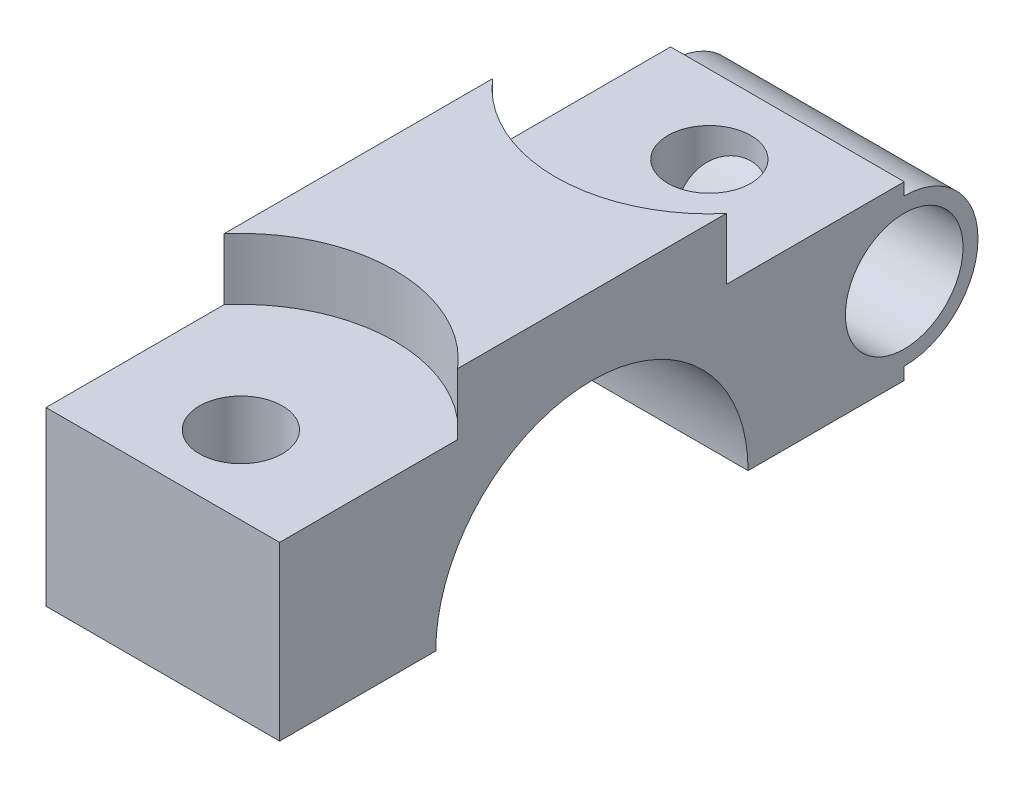
ISO-10303-21;
HEADER;
FILE_DESCRIPTION(('STEP AP214'),'2;1');
FILE_NAME('part.step','',(''),(''),'','','');
FILE_SCHEMA(('AUTOMOTIVE_DESIGN { 1 0 10303 214 1 1 1 1 }'));
ENDSEC;
DATA;
#1=APPLICATION_CONTEXT('core data for automotive mechanical design processes');
#2=APPLICATION_PROTOCOL_DEFINITION('international standard','automotive_design',2000,#1);
#3=PRODUCT_CONTEXT('',#1,'mechanical');
#4=PRODUCT('Part','Part','',(#3));
#5=PRODUCT_RELATED_PRODUCT_CATEGORY('part','',(#4));
#6=PRODUCT_DEFINITION_FORMATION('','',#4);
#7=PRODUCT_DEFINITION_CONTEXT('part definition',#1,'design');
#8=PRODUCT_DEFINITION('design','',#6,#7);
#9=PRODUCT_DEFINITION_SHAPE('','',#8);
#10=(LENGTH_UNIT() NAMED_UNIT(*) SI_UNIT(.MILLI.,.METRE.));
#11=(NAMED_UNIT(*) PLANE_ANGLE_UNIT() SI_UNIT($,.RADIAN.));
#12=(NAMED_UNIT(*) SI_UNIT($,.STERADIAN.) SOLID_ANGLE_UNIT());
#13=UNCERTAINTY_MEASURE_WITH_UNIT(LENGTH_MEASURE(1.E-05),#10,'distance_accuracy_value','');
#14=(GEOMETRIC_REPRESENTATION_CONTEXT(3) GLOBAL_UNCERTAINTY_ASSIGNED_CONTEXT((#13)) GLOBAL_UNIT_ASSIGNED_CONTEXT((#10,
#11,#12)) REPRESENTATION_CONTEXT('',''));
#15=CARTESIAN_POINT('',(0.,0.,0.));
#16=DIRECTION('',(0.,0.,1.));
#17=DIRECTION('',(1.,0.,0.));
#18=AXIS2_PLACEMENT_3D('',#15,#16,#17);
#19=CARTESIAN_POINT('',(9.5,19.,-25.4));
#20=DIRECTION('',(0.,0.,1.));
#21=DIRECTION('',(0.,-1.,0.));
#22=AXIS2_PLACEMENT_3D('',#19,#20,#21);
#23=PLANE('',#22);
#24=DIRECTION('',(0.,1.,0.));
#25=VECTOR('',#24,1.);
#26=CARTESIAN_POINT('',(-9.5,19.,-25.4));
#27=LINE('',#26,#25);
#28=CARTESIAN_POINT('',(-9.5,0.,-25.4));
#29=VERTEX_POINT('',#28);
#30=CARTESIAN_POINT('',(-9.5,1.,-25.4));
#31=VERTEX_POINT('',#30);
#32=EDGE_CURVE('E199',#29,#31,#27,.T.);
#33=ORIENTED_EDGE('',*,*,#32,.T.);
#34=DIRECTION('',(1.,0.,0.));
#35=VECTOR('',#34,1.);
#36=CARTESIAN_POINT('',(-9.5,1.,-25.4));
#37=LINE('',#36,#35);
#38=CARTESIAN_POINT('',(9.5,1.,-25.4));
#39=VERTEX_POINT('',#38);
#40=EDGE_CURVE('E66',#31,#39,#37,.T.);
#41=ORIENTED_EDGE('',*,*,#40,.T.);
#42=DIRECTION('',(0.,1.,0.));
#43=VECTOR('',#42,1.);
#44=CARTESIAN_POINT('',(9.5,19.,-25.4));
#45=LINE('',#44,#43);
#46=CARTESIAN_POINT('',(9.5,0.,-25.4));
#47=VERTEX_POINT('',#46);
#48=EDGE_CURVE('E186',#47,#39,#45,.T.);
#49=ORIENTED_EDGE('',*,*,#48,.F.);
#50=DIRECTION('',(-1.,0.,0.));
#51=VECTOR('',#50,1.);
#52=CARTESIAN_POINT('',(9.5,0.,-25.4));
#53=LINE('',#52,#51);
#54=EDGE_CURVE('E190',#47,#29,#53,.T.);
#55=ORIENTED_EDGE('',*,*,#54,.T.);
#56=EDGE_LOOP('',(#33,#41,#49,#55));
#57=FACE_BOUND('',#56,.T.);
#58=ADVANCED_FACE('F37',(#57),#23,.F.);
#59=CARTESIAN_POINT('',(9.5,19.,25.4));
#60=DIRECTION('',(0.,-1.,0.));
#61=DIRECTION('',(0.,0.,-1.));
#62=AXIS2_PLACEMENT_3D('',#59,#60,#61);
#63=PLANE('',#62);
#64=DIRECTION('',(0.,0.,1.));
#65=VECTOR('',#64,1.);
#66=CARTESIAN_POINT('',(9.5,19.,25.4));
#67=LINE('',#66,#65);
#68=CARTESIAN_POINT('',(9.5,19.,-10.925961595364));
#69=VERTEX_POINT('',#68);
#70=CARTESIAN_POINT('',(9.5,19.,10.925961595364));
#71=VERTEX_POINT('',#70);
#72=EDGE_CURVE('E188',#69,#71,#67,.T.);
#73=ORIENTED_EDGE('',*,*,#72,.F.);
#74=CARTESIAN_POINT('',(0.,19.,-19.05));
#75=DIRECTION('',(0.,1.,0.));
#76=DIRECTION('',(0.,0.,1.));
#77=AXIS2_PLACEMENT_3D('',#74,#75,#76);
#78=CIRCLE('',#77,12.5);
#79=CARTESIAN_POINT('',(-9.5,19.,-10.925961595364));
#80=VERTEX_POINT('',#79);
#81=EDGE_CURVE('E138',#80,#69,#78,.T.);
#82=ORIENTED_EDGE('',*,*,#81,.F.);
#83=DIRECTION('',(0.,0.,1.));
#84=VECTOR('',#83,1.);
#85=CARTESIAN_POINT('',(-9.5,19.,25.4));
#86=LINE('',#85,#84);
#87=CARTESIAN_POINT('',(-9.5,19.,10.925961595364));
#88=VERTEX_POINT('',#87);
#89=EDGE_CURVE('E180',#80,#88,#86,.T.);
#90=ORIENTED_EDGE('',*,*,#89,.T.);
#91=CARTESIAN_POINT('',(0.,19.,19.05));
#92=DIRECTION('',(0.,1.,0.));
#93=DIRECTION('',(0.,0.,1.));
#94=AXIS2_PLACEMENT_3D('',#91,#92,#93);
#95=CIRCLE('',#94,12.5);
#96=EDGE_CURVE('E142',#71,#88,#95,.T.);
#97=ORIENTED_EDGE('',*,*,#96,.F.);
#98=EDGE_LOOP('',(#73,#82,#90,#97));
#99=FACE_BOUND('',#98,.T.);
#100=ADVANCED_FACE('F248',(#99),#63,.F.);
#101=CARTESIAN_POINT('',(9.5,19.,25.4));
#102=DIRECTION('',(0.,0.,-1.));
#103=DIRECTION('',(0.,1.,0.));
#104=AXIS2_PLACEMENT_3D('',#101,#102,#103);
#105=PLANE('',#104);
#106=DIRECTION('',(0.,-1.,0.));
#107=VECTOR('',#106,1.);
#108=CARTESIAN_POINT('',(9.5,19.,25.4));
#109=LINE('',#108,#107);
#110=CARTESIAN_POINT('',(9.5,14.,25.4));
#111=VERTEX_POINT('',#110);
#112=CARTESIAN_POINT('',(9.5,0.,25.4));
#113=VERTEX_POINT('',#112);
#114=EDGE_CURVE('E177',#111,#113,#109,.T.);
#115=ORIENTED_EDGE('',*,*,#114,.F.);
#116=DIRECTION('',(-1.,0.,0.));
#117=VECTOR('',#116,1.);
#118=CARTESIAN_POINT('',(9.5,14.,25.4));
#119=LINE('',#118,#117);
#120=CARTESIAN_POINT('',(-9.5,14.,25.4));
#121=VERTEX_POINT('',#120);
#122=EDGE_CURVE('E173',#111,#121,#119,.T.);
#123=ORIENTED_EDGE('',*,*,#122,.T.);
#124=DIRECTION('',(0.,-1.,0.));
#125=VECTOR('',#124,1.);
#126=CARTESIAN_POINT('',(-9.5,19.,25.4));
#127=LINE('',#126,#125);
#128=CARTESIAN_POINT('',(-9.5,0.,25.4));
#129=VERTEX_POINT('',#128);
#130=EDGE_CURVE('E176',#121,#129,#127,.T.);
#131=ORIENTED_EDGE('',*,*,#130,.T.);
#132=DIRECTION('',(-1.,0.,0.));
#133=VECTOR('',#132,1.);
#134=CARTESIAN_POINT('',(9.5,0.,25.4));
#135=LINE('',#134,#133);
#136=EDGE_CURVE('E210',#113,#129,#135,.T.);
#137=ORIENTED_EDGE('',*,*,#136,.F.);
#138=EDGE_LOOP('',(#115,#123,#131,#137));
#139=FACE_BOUND('',#138,.T.);
#140=ADVANCED_FACE('F39',(#139),#105,.F.);
#141=CARTESIAN_POINT('',(9.5,0.,25.4));
#142=DIRECTION('',(0.,1.,0.));
#143=DIRECTION('',(0.,0.,1.));
#144=AXIS2_PLACEMENT_3D('',#141,#142,#143);
#145=PLANE('',#144);
#146=CARTESIAN_POINT('',(0.,0.,19.05));
#147=DIRECTION('',(0.,1.,0.));
#148=DIRECTION('',(0.,0.,1.));
#149=AXIS2_PLACEMENT_3D('',#146,#147,#148);
#150=CIRCLE('',#149,3.37500000000003);
#151=CARTESIAN_POINT('',(0.,0.,22.425));
#152=VERTEX_POINT('',#151);
#153=EDGE_CURVE('E168',#152,#152,#150,.T.);
#154=ORIENTED_EDGE('',*,*,#153,.T.);
#155=EDGE_LOOP('',(#154));
#156=FACE_BOUND('',#155,.T.);
#157=DIRECTION('',(0.,0.,-1.));
#158=VECTOR('',#157,1.);
#159=CARTESIAN_POINT('',(-9.5,0.,25.4));
#160=LINE('',#159,#158);
#161=CARTESIAN_POINT('',(-9.5,0.,12.7));
#162=VERTEX_POINT('',#161);
#163=EDGE_CURVE('E192',#129,#162,#160,.T.);
#164=ORIENTED_EDGE('',*,*,#163,.T.);
#165=DIRECTION('',(-1.,0.,0.));
#166=VECTOR('',#165,1.);
#167=CARTESIAN_POINT('',(9.5,0.,12.7));
#168=LINE('',#167,#166);
#169=CARTESIAN_POINT('',(9.5,0.,12.7));
#170=VERTEX_POINT('',#169);
#171=EDGE_CURVE('E207',#170,#162,#168,.T.);
#172=ORIENTED_EDGE('',*,*,#171,.F.);
#173=DIRECTION('',(0.,0.,-1.));
#174=VECTOR('',#173,1.);
#175=CARTESIAN_POINT('',(9.5,0.,25.4));
#176=LINE('',#175,#174);
#177=EDGE_CURVE('E179',#113,#170,#176,.T.);
#178=ORIENTED_EDGE('',*,*,#177,.F.);
#179=ORIENTED_EDGE('',*,*,#136,.T.);
#180=EDGE_LOOP('',(#164,#172,#178,#179));
#181=FACE_BOUND('',#180,.T.);
#182=ADVANCED_FACE('F240',(#156,#181),#145,.F.);
#183=CARTESIAN_POINT('',(9.5,0.,0.));
#184=DIRECTION('',(-1.,0.,0.));
#185=DIRECTION('',(0.,0.,1.));
#186=AXIS2_PLACEMENT_3D('',#183,#184,#185);
#187=CYLINDRICAL_SURFACE('',#186,12.7);
#188=CARTESIAN_POINT('',(-9.5,0.,0.));
#189=DIRECTION('',(-1.,0.,0.));
#190=DIRECTION('',(0.,0.,1.));
#191=AXIS2_PLACEMENT_3D('',#188,#189,#190);
#192=CIRCLE('',#191,12.7);
#193=CARTESIAN_POINT('',(-9.5,0.,-12.7));
#194=VERTEX_POINT('',#193);
#195=EDGE_CURVE('E194',#162,#194,#192,.T.);
#196=ORIENTED_EDGE('',*,*,#195,.T.);
#197=DIRECTION('',(-1.,0.,0.));
#198=VECTOR('',#197,1.);
#199=CARTESIAN_POINT('',(9.5,0.,-12.7));
#200=LINE('',#199,#198);
#201=CARTESIAN_POINT('',(9.5,0.,-12.7));
#202=VERTEX_POINT('',#201);
#203=EDGE_CURVE('E204',#202,#194,#200,.T.);
#204=ORIENTED_EDGE('',*,*,#203,.F.);
#205=CARTESIAN_POINT('',(9.5,0.,0.));
#206=DIRECTION('',(-1.,0.,0.));
#207=DIRECTION('',(0.,0.,1.));
#208=AXIS2_PLACEMENT_3D('',#205,#206,#207);
#209=CIRCLE('',#208,12.7);
#210=EDGE_CURVE('E182',#170,#202,#209,.T.);
#211=ORIENTED_EDGE('',*,*,#210,.F.);
#212=ORIENTED_EDGE('',*,*,#171,.T.);
#213=EDGE_LOOP('',(#196,#204,#211,#212));
#214=FACE_BOUND('',#213,.T.);
#215=ADVANCED_FACE('F309',(#214),#187,.F.);
#216=CARTESIAN_POINT('',(9.5,0.,-12.7));
#217=DIRECTION('',(0.,1.,0.));
#218=DIRECTION('',(0.,0.,1.));
#219=AXIS2_PLACEMENT_3D('',#216,#217,#218);
#220=PLANE('',#219);
#221=CARTESIAN_POINT('',(0.,0.,-19.05));
#222=DIRECTION('',(0.,1.,0.));
#223=DIRECTION('',(0.,0.,1.));
#224=AXIS2_PLACEMENT_3D('',#221,#222,#223);
#225=CIRCLE('',#224,3.37500000000003);
#226=CARTESIAN_POINT('',(0.,0.,-15.675));
#227=VERTEX_POINT('',#226);
#228=EDGE_CURVE('E156',#227,#227,#225,.T.);
#229=ORIENTED_EDGE('',*,*,#228,.T.);
#230=EDGE_LOOP('',(#229));
#231=FACE_BOUND('',#230,.T.);
#232=DIRECTION('',(0.,0.,-1.));
#233=VECTOR('',#232,1.);
#234=CARTESIAN_POINT('',(-9.5,0.,-12.7));
#235=LINE('',#234,#233);
#236=EDGE_CURVE('E196',#194,#29,#235,.T.);
#237=ORIENTED_EDGE('',*,*,#236,.T.);
#238=ORIENTED_EDGE('',*,*,#54,.F.);
#239=DIRECTION('',(0.,0.,-1.));
#240=VECTOR('',#239,1.);
#241=CARTESIAN_POINT('',(9.5,0.,-12.7));
#242=LINE('',#241,#240);
#243=EDGE_CURVE('E184',#202,#47,#242,.T.);
#244=ORIENTED_EDGE('',*,*,#243,.F.);
#245=ORIENTED_EDGE('',*,*,#203,.T.);
#246=EDGE_LOOP('',(#237,#238,#244,#245));
#247=FACE_BOUND('',#246,.T.);
#248=ADVANCED_FACE('F276',(#231,#247),#220,.F.);
#249=CARTESIAN_POINT('',(9.5,13.,-25.4));
#250=VERTEX_POINT('',#249);
#251=CARTESIAN_POINT('',(9.5,14.,-25.4));
#252=VERTEX_POINT('',#251);
#253=EDGE_CURVE('E58',#250,#252,#45,.T.);
#254=ORIENTED_EDGE('',*,*,#253,.F.);
#255=DIRECTION('',(1.,0.,0.));
#256=VECTOR('',#255,1.);
#257=CARTESIAN_POINT('',(-9.5,13.,-25.4));
#258=LINE('',#257,#256);
#259=CARTESIAN_POINT('',(-9.5,13.,-25.4));
#260=VERTEX_POINT('',#259);
#261=EDGE_CURVE('E257',#250,#260,#258,.F.);
#262=ORIENTED_EDGE('',*,*,#261,.T.);
#263=CARTESIAN_POINT('',(-9.5,14.,-25.4));
#264=VERTEX_POINT('',#263);
#265=EDGE_CURVE('E198',#260,#264,#27,.T.);
#266=ORIENTED_EDGE('',*,*,#265,.T.);
#267=DIRECTION('',(1.,0.,0.));
#268=VECTOR('',#267,1.);
#269=CARTESIAN_POINT('',(9.5,14.,-25.4));
#270=LINE('',#269,#268);
#271=EDGE_CURVE('E154',#264,#252,#270,.T.);
#272=ORIENTED_EDGE('',*,*,#271,.T.);
#273=EDGE_LOOP('',(#254,#262,#266,#272));
#274=FACE_BOUND('',#273,.T.);
#275=ADVANCED_FACE('F295',(#274),#23,.F.);
#276=CARTESIAN_POINT('',(9.5,0.,0.));
#277=DIRECTION('',(-1.,0.,0.));
#278=DIRECTION('',(0.,0.,1.));
#279=AXIS2_PLACEMENT_3D('',#276,#277,#278);
#280=PLANE('',#279);
#281=CARTESIAN_POINT('',(9.5,7.,-25.4));
#282=DIRECTION('',(1.,0.,0.));
#283=DIRECTION('',(0.,0.,-1.));
#284=AXIS2_PLACEMENT_3D('',#281,#282,#283);
#285=CIRCLE('',#284,4.785);
#286=CARTESIAN_POINT('',(9.5,7.,-30.185));
#287=VERTEX_POINT('',#286);
#288=EDGE_CURVE('E265',#287,#287,#285,.T.);
#289=ORIENTED_EDGE('',*,*,#288,.F.);
#290=EDGE_LOOP('',(#289));
#291=FACE_BOUND('',#290,.T.);
#292=ORIENTED_EDGE('',*,*,#48,.T.);
#293=CARTESIAN_POINT('',(9.5,7.,-25.4));
#294=DIRECTION('',(1.,0.,0.));
#295=DIRECTION('',(0.,0.,-1.));
#296=AXIS2_PLACEMENT_3D('',#293,#294,#295);
#297=CIRCLE('',#296,6.);
#298=EDGE_CURVE('E258',#39,#250,#297,.T.);
#299=ORIENTED_EDGE('',*,*,#298,.T.);
#300=ORIENTED_EDGE('',*,*,#253,.T.);
#301=DIRECTION('',(0.,0.,1.));
#302=VECTOR('',#301,1.);
#303=CARTESIAN_POINT('',(9.5,14.,0.));
#304=LINE('',#303,#302);
#305=CARTESIAN_POINT('',(9.5,14.,-10.925961595364));
#306=VERTEX_POINT('',#305);
#307=EDGE_CURVE('E143',#252,#306,#304,.T.);
#308=ORIENTED_EDGE('',*,*,#307,.T.);
#309=DIRECTION('',(0.,1.,0.));
#310=VECTOR('',#309,1.);
#311=CARTESIAN_POINT('',(9.5,19.,-10.925961595364));
#312=LINE('',#311,#310);
#313=EDGE_CURVE('E132',#306,#69,#312,.T.);
#314=ORIENTED_EDGE('',*,*,#313,.T.);
#315=ORIENTED_EDGE('',*,*,#72,.T.);
#316=DIRECTION('',(0.,1.,0.));
#317=VECTOR('',#316,1.);
#318=CARTESIAN_POINT('',(9.5,19.,10.925961595364));
#319=LINE('',#318,#317);
#320=CARTESIAN_POINT('',(9.5,14.,10.925961595364));
#321=VERTEX_POINT('',#320);
#322=EDGE_CURVE('E213',#71,#321,#319,.F.);
#323=ORIENTED_EDGE('',*,*,#322,.T.);
#324=DIRECTION('',(0.,0.,1.));
#325=VECTOR('',#324,1.);
#326=CARTESIAN_POINT('',(9.5,14.,0.));
#327=LINE('',#326,#325);
#328=EDGE_CURVE('E216',#321,#111,#327,.T.);
#329=ORIENTED_EDGE('',*,*,#328,.T.);
#330=ORIENTED_EDGE('',*,*,#114,.T.);
#331=ORIENTED_EDGE('',*,*,#177,.T.);
#332=ORIENTED_EDGE('',*,*,#210,.T.);
#333=ORIENTED_EDGE('',*,*,#243,.T.);
#334=EDGE_LOOP('',(#292,#299,#300,#308,#314,#315,#323,#329,#330,#331,#332,#333));
#335=FACE_BOUND('',#334,.T.);
#336=ADVANCED_FACE('F152',(#291,#335),#280,.F.);
#337=CARTESIAN_POINT('',(-9.5,0.,0.));
#338=DIRECTION('',(-1.,0.,0.));
#339=DIRECTION('',(0.,0.,1.));
#340=AXIS2_PLACEMENT_3D('',#337,#338,#339);
#341=PLANE('',#340);
#342=CARTESIAN_POINT('',(-9.5,7.,-25.4));
#343=DIRECTION('',(1.,0.,0.));
#344=DIRECTION('',(0.,0.,-1.));
#345=AXIS2_PLACEMENT_3D('',#342,#343,#344);
#346=CIRCLE('',#345,4.785);
#347=CARTESIAN_POINT('',(-9.5,7.,-30.185));
#348=VERTEX_POINT('',#347);
#349=EDGE_CURVE('E266',#348,#348,#346,.T.);
#350=ORIENTED_EDGE('',*,*,#349,.T.);
#351=EDGE_LOOP('',(#350));
#352=FACE_BOUND('',#351,.T.);
#353=ORIENTED_EDGE('',*,*,#265,.F.);
#354=CARTESIAN_POINT('',(-9.5,7.,-25.4));
#355=DIRECTION('',(1.,0.,0.));
#356=DIRECTION('',(0.,0.,-1.));
#357=AXIS2_PLACEMENT_3D('',#354,#355,#356);
#358=CIRCLE('',#357,6.);
#359=EDGE_CURVE('E253',#31,#260,#358,.T.);
#360=ORIENTED_EDGE('',*,*,#359,.F.);
#361=ORIENTED_EDGE('',*,*,#32,.F.);
#362=ORIENTED_EDGE('',*,*,#236,.F.);
#363=ORIENTED_EDGE('',*,*,#195,.F.);
#364=ORIENTED_EDGE('',*,*,#163,.F.);
#365=ORIENTED_EDGE('',*,*,#130,.F.);
#366=DIRECTION('',(0.,0.,1.));
#367=VECTOR('',#366,1.);
#368=CARTESIAN_POINT('',(-9.5,14.,0.));
#369=LINE('',#368,#367);
#370=CARTESIAN_POINT('',(-9.5,14.,10.925961595364));
#371=VERTEX_POINT('',#370);
#372=EDGE_CURVE('E219',#371,#121,#369,.T.);
#373=ORIENTED_EDGE('',*,*,#372,.F.);
#374=DIRECTION('',(0.,1.,0.));
#375=VECTOR('',#374,1.);
#376=CARTESIAN_POINT('',(-9.5,19.,10.925961595364));
#377=LINE('',#376,#375);
#378=EDGE_CURVE('E171',#88,#371,#377,.F.);
#379=ORIENTED_EDGE('',*,*,#378,.F.);
#380=ORIENTED_EDGE('',*,*,#89,.F.);
#381=DIRECTION('',(0.,1.,0.));
#382=VECTOR('',#381,1.);
#383=CARTESIAN_POINT('',(-9.5,19.,-10.925961595364));
#384=LINE('',#383,#382);
#385=CARTESIAN_POINT('',(-9.5,14.,-10.925961595364));
#386=VERTEX_POINT('',#385);
#387=EDGE_CURVE('E11',#386,#80,#384,.T.);
#388=ORIENTED_EDGE('',*,*,#387,.F.);
#389=DIRECTION('',(0.,0.,1.));
#390=VECTOR('',#389,1.);
#391=CARTESIAN_POINT('',(-9.5,14.,0.));
#392=LINE('',#391,#390);
#393=EDGE_CURVE('E51',#264,#386,#392,.T.);
#394=ORIENTED_EDGE('',*,*,#393,.F.);
#395=EDGE_LOOP('',(#353,#360,#361,#362,#363,#364,#365,#373,#379,#380,#388,#394));
#396=FACE_BOUND('',#395,.T.);
#397=ADVANCED_FACE('F234',(#352,#396),#341,.T.);
#398=CARTESIAN_POINT('',(0.,19.,19.05));
#399=DIRECTION('',(0.,1.,0.));
#400=DIRECTION('',(0.,0.,1.));
#401=AXIS2_PLACEMENT_3D('',#398,#399,#400);
#402=CYLINDRICAL_SURFACE('',#401,3.37500000000004);
#403=ORIENTED_EDGE('',*,*,#153,.F.);
#404=EDGE_LOOP('',(#403));
#405=FACE_BOUND('',#404,.T.);
#406=CARTESIAN_POINT('',(0.,14.,19.05));
#407=DIRECTION('',(0.,1.,0.));
#408=DIRECTION('',(0.,0.,1.));
#409=AXIS2_PLACEMENT_3D('',#406,#407,#408);
#410=CIRCLE('',#409,3.37500000000004);
#411=CARTESIAN_POINT('',(0.,14.,22.425));
#412=VERTEX_POINT('',#411);
#413=EDGE_CURVE('E165',#412,#412,#410,.T.);
#414=ORIENTED_EDGE('',*,*,#413,.T.);
#415=EDGE_LOOP('',(#414));
#416=FACE_BOUND('',#415,.T.);
#417=ADVANCED_FACE('F322',(#405,#416),#402,.F.);
#418=CARTESIAN_POINT('',(3.37500000000004,14.,19.05));
#419=DIRECTION('',(0.,-1.,0.));
#420=DIRECTION('',(0.,0.,-1.));
#421=AXIS2_PLACEMENT_3D('',#418,#419,#420);
#422=PLANE('',#421);
#423=ORIENTED_EDGE('',*,*,#372,.T.);
#424=ORIENTED_EDGE('',*,*,#122,.F.);
#425=ORIENTED_EDGE('',*,*,#328,.F.);
#426=CARTESIAN_POINT('',(0.,14.,19.05));
#427=DIRECTION('',(0.,1.,0.));
#428=DIRECTION('',(0.,0.,1.));
#429=AXIS2_PLACEMENT_3D('',#426,#427,#428);
#430=CIRCLE('',#429,12.5);
#431=EDGE_CURVE('E162',#321,#371,#430,.T.);
#432=ORIENTED_EDGE('',*,*,#431,.T.);
#433=EDGE_LOOP('',(#423,#424,#425,#432));
#434=FACE_BOUND('',#433,.T.);
#435=ORIENTED_EDGE('',*,*,#413,.F.);
#436=EDGE_LOOP('',(#435));
#437=FACE_BOUND('',#436,.T.);
#438=ADVANCED_FACE('F223',(#434,#437),#422,.F.);
#439=CARTESIAN_POINT('',(0.,19.,19.05));
#440=DIRECTION('',(0.,1.,0.));
#441=DIRECTION('',(0.,0.,1.));
#442=AXIS2_PLACEMENT_3D('',#439,#440,#441);
#443=CYLINDRICAL_SURFACE('',#442,12.5);
#444=ORIENTED_EDGE('',*,*,#378,.T.);
#445=ORIENTED_EDGE('',*,*,#431,.F.);
#446=ORIENTED_EDGE('',*,*,#322,.F.);
#447=ORIENTED_EDGE('',*,*,#96,.T.);
#448=EDGE_LOOP('',(#444,#445,#446,#447));
#449=FACE_BOUND('',#448,.T.);
#450=ADVANCED_FACE('F246',(#449),#443,.F.);
#451=CARTESIAN_POINT('',(0.,19.,-19.05));
#452=DIRECTION('',(0.,1.,0.));
#453=DIRECTION('',(0.,0.,1.));
#454=AXIS2_PLACEMENT_3D('',#451,#452,#453);
#455=CYLINDRICAL_SURFACE('',#454,12.5);
#456=CARTESIAN_POINT('',(0.,14.,-19.05));
#457=DIRECTION('',(0.,1.,0.));
#458=DIRECTION('',(0.,0.,1.));
#459=AXIS2_PLACEMENT_3D('',#456,#457,#458);
#460=CIRCLE('',#459,12.5);
#461=EDGE_CURVE('E135',#386,#306,#460,.T.);
#462=ORIENTED_EDGE('',*,*,#461,.F.);
#463=ORIENTED_EDGE('',*,*,#387,.T.);
#464=ORIENTED_EDGE('',*,*,#81,.T.);
#465=ORIENTED_EDGE('',*,*,#313,.F.);
#466=EDGE_LOOP('',(#462,#463,#464,#465));
#467=FACE_BOUND('',#466,.T.);
#468=ADVANCED_FACE('F134',(#467),#455,.F.);
#469=CARTESIAN_POINT('',(3.37500000000004,14.,-19.05));
#470=DIRECTION('',(0.,-1.,0.));
#471=DIRECTION('',(0.,0.,-1.));
#472=AXIS2_PLACEMENT_3D('',#469,#470,#471);
#473=PLANE('',#472);
#474=CARTESIAN_POINT('',(0.,14.,-19.05));
#475=DIRECTION('',(0.,1.,0.));
#476=DIRECTION('',(0.,0.,1.));
#477=AXIS2_PLACEMENT_3D('',#474,#475,#476);
#478=CIRCLE('',#477,3.37500000000004);
#479=CARTESIAN_POINT('',(0.,14.,-15.675));
#480=VERTEX_POINT('',#479);
#481=EDGE_CURVE('E150',#480,#480,#478,.T.);
#482=ORIENTED_EDGE('',*,*,#481,.F.);
#483=EDGE_LOOP('',(#482));
#484=FACE_BOUND('',#483,.T.);
#485=ORIENTED_EDGE('',*,*,#271,.F.);
#486=ORIENTED_EDGE('',*,*,#393,.T.);
#487=ORIENTED_EDGE('',*,*,#461,.T.);
#488=ORIENTED_EDGE('',*,*,#307,.F.);
#489=EDGE_LOOP('',(#485,#486,#487,#488));
#490=FACE_BOUND('',#489,.T.);
#491=ADVANCED_FACE('F148',(#484,#490),#473,.F.);
#492=CARTESIAN_POINT('',(0.,19.,-19.05));
#493=DIRECTION('',(0.,1.,0.));
#494=DIRECTION('',(0.,0.,1.));
#495=AXIS2_PLACEMENT_3D('',#492,#493,#494);
#496=CYLINDRICAL_SURFACE('',#495,3.37500000000004);
#497=CARTESIAN_POINT('',(0.,1.78949378658846,-22.425));
#498=CARTESIAN_POINT('',(-0.164610612435493,1.78949228273727,-22.4249889217012));
#499=CARTESIAN_POINT('',(-0.329359407446275,1.79634864370434,-22.4128929944011));
#500=CARTESIAN_POINT('',(-0.654318170210795,1.82411429569063,-22.365046699683));
#501=CARTESIAN_POINT('',(-0.814522080307723,1.84504150106598,-22.329266179025));
#502=CARTESIAN_POINT('',(-1.12561953749952,1.90182118074771,-22.2358982058748));
#503=CARTESIAN_POINT('',(-1.27651651687952,1.93766811458826,-22.1783188491332));
#504=CARTESIAN_POINT('',(-1.56472960170586,2.02531711555905,-22.0445742984779));
#505=CARTESIAN_POINT('',(-1.70205219642353,2.07711150975586,-21.9684180462726));
#506=CARTESIAN_POINT('',(-1.95966599360204,2.19736436729882,-21.8020598789415));
#507=CARTESIAN_POINT('',(-2.07996876236016,2.26581142699491,-21.7118675907788));
#508=CARTESIAN_POINT('',(-2.30154572496009,2.41937379685092,-21.5228019023927));
#509=CARTESIAN_POINT('',(-2.40281736596376,2.50449134006894,-21.4239273401341));
#510=CARTESIAN_POINT('',(-2.59004589855978,2.69468918169324,-21.2185231960688));
#511=CARTESIAN_POINT('',(-2.67509380234158,2.80050281907086,-21.1118501442351));
#512=CARTESIAN_POINT('',(-2.825241260519,3.02744452995662,-20.9007978388811));
#513=CARTESIAN_POINT('',(-2.89032975236405,3.14858104386006,-20.7964198870672));
#514=CARTESIAN_POINT('',(-2.98774192259793,3.36894319366895,-20.6219772439444));
#515=CARTESIAN_POINT('',(-3.02416133833067,3.46515344610351,-20.5503082771259));
#516=CARTESIAN_POINT('',(-3.08903763853527,3.66355627876987,-20.4117361452778));
#517=CARTESIAN_POINT('',(-3.11749159504586,3.76575104215468,-20.3448347394372));
#518=CARTESIAN_POINT('',(-3.16769833965326,3.97543726607971,-20.216646017154));
#519=CARTESIAN_POINT('',(-3.18943808081576,4.08293857411571,-20.1553697917362));
#520=CARTESIAN_POINT('',(-3.22734900520206,4.30230745441519,-20.0392288559609));
#521=CARTESIAN_POINT('',(-3.24351891434562,4.41417601916706,-19.9843656144454));
#522=CARTESIAN_POINT('',(-3.27516995537299,4.67238969102385,-19.867607101887));
#523=CARTESIAN_POINT('',(-3.28927806128028,4.81986542980921,-19.8078325596125));
#524=CARTESIAN_POINT('',(-3.3122563888229,5.11947418021581,-19.7000889246394));
#525=CARTESIAN_POINT('',(-3.32112529943326,5.27160834752541,-19.6521227885559));
#526=CARTESIAN_POINT('',(-3.33521454568542,5.57935753305021,-19.5684305871846));
#527=CARTESIAN_POINT('',(-3.34043505626206,5.73497238400302,-19.5327039350754));
#528=CARTESIAN_POINT('',(-3.34842277429364,6.04859808406172,-19.4737622378769));
#529=CARTESIAN_POINT('',(-3.35119016001515,6.20660875821621,-19.4505462836937));
#530=CARTESIAN_POINT('',(-3.35506937630142,6.5252874817046,-19.4166453908568));
#531=CARTESIAN_POINT('',(-3.3561675683508,6.68596669127151,-19.4060638330156));
#532=CARTESIAN_POINT('',(-3.35702901967842,7.00766162114484,-19.3978477883053));
#533=CARTESIAN_POINT('',(-3.35679225260804,7.16867734803054,-19.4002135569826));
#534=CARTESIAN_POINT('',(-3.35490176131301,7.49011185996075,-19.4178835560428));
#535=CARTESIAN_POINT('',(-3.35324697210626,7.6505301053081,-19.4331975108316));
#536=CARTESIAN_POINT('',(-3.3479926750296,7.96958591415879,-19.4766711154841));
#537=CARTESIAN_POINT('',(-3.34439315991934,8.12822347103027,-19.5048308131731));
#538=CARTESIAN_POINT('',(-3.33407590301915,8.44927140306697,-19.5752474344996));
#539=CARTESIAN_POINT('',(-3.32723313160388,8.61155899297002,-19.6180484910329));
#540=CARTESIAN_POINT('',(-3.30881340657371,8.93178304140147,-19.7170168285611));
#541=CARTESIAN_POINT('',(-3.29723551297134,9.08971862934873,-19.7731867625376));
#542=CARTESIAN_POINT('',(-3.26731387075768,9.39954717329566,-19.8981793306386));
#543=CARTESIAN_POINT('',(-3.2489815794303,9.55144988210417,-19.9669804402935));
#544=CARTESIAN_POINT('',(-3.20306912162038,9.84787238584862,-20.1163354128355));
#545=CARTESIAN_POINT('',(-3.17549463872976,9.99239665545118,-20.1968820355285));
#546=CARTESIAN_POINT('',(-3.12031759016645,10.2221863219176,-20.3375261567957));
#547=CARTESIAN_POINT('',(-3.09625488421003,10.3101530882778,-20.3946292642042));
#548=CARTESIAN_POINT('',(-3.04237208318048,10.4817794986399,-20.5124615710283));
#549=CARTESIAN_POINT('',(-3.01255365654253,10.5654403819261,-20.5731897161234));
#550=CARTESIAN_POINT('',(-2.9464345665415,10.7277963546625,-20.6974504985127));
#551=CARTESIAN_POINT('',(-2.91014286422589,10.806498107845,-20.7609791686199));
#552=CARTESIAN_POINT('',(-2.83034775567084,10.9584835153821,-20.8899738650008));
#553=CARTESIAN_POINT('',(-2.78684540680425,11.0317679618583,-20.9554396060668));
#554=CARTESIAN_POINT('',(-2.69968822840417,11.1610582687345,-21.0765597368412));
#555=CARTESIAN_POINT('',(-2.65718262243473,11.2179476895447,-21.1320991630584));
#556=CARTESIAN_POINT('',(-2.56646965215176,11.3272280913179,-21.2429396574407));
#557=CARTESIAN_POINT('',(-2.5182633349237,11.3796198953446,-21.2982407674508));
#558=CARTESIAN_POINT('',(-2.41602768118566,11.4796818580723,-21.407763158745));
#559=CARTESIAN_POINT('',(-2.36199716416175,11.5273510557708,-21.4619842184637));
#560=CARTESIAN_POINT('',(-2.24818590853238,11.6177628111039,-21.5684023829401));
#561=CARTESIAN_POINT('',(-2.18840787457333,11.6605076654034,-21.6206004236142));
#562=CARTESIAN_POINT('',(-2.06296774344377,11.7411992878501,-21.7223286715061));
#563=CARTESIAN_POINT('',(-1.99727862458643,11.7791218877653,-21.7718447776265));
#564=CARTESIAN_POINT('',(-1.8606338136431,11.849903378835,-21.8670189705483));
#565=CARTESIAN_POINT('',(-1.78968025891396,11.8827643085351,-21.9126786071465));
#566=CARTESIAN_POINT('',(-1.64293779950796,11.9435167182988,-21.9993462779951));
#567=CARTESIAN_POINT('',(-1.5671476571999,11.9714069194251,-22.0403531141256));
#568=CARTESIAN_POINT('',(-1.41133030623546,12.0223336243153,-22.1169704715401));
#569=CARTESIAN_POINT('',(-1.33130335930338,12.0453704274563,-22.1525813256317));
#570=CARTESIAN_POINT('',(-1.17418522030237,12.0851066144572,-22.2151994410762));
#571=CARTESIAN_POINT('',(-1.09736690857183,12.1021643565323,-22.24266576341));
#572=CARTESIAN_POINT('',(-0.94122432172044,12.1324467184853,-22.2921338292049));
#573=CARTESIAN_POINT('',(-0.861899183683418,12.1456700021454,-22.3141336673446));
#574=CARTESIAN_POINT('',(-0.701379187360703,12.1683948361081,-22.3523464202544));
#575=CARTESIAN_POINT('',(-0.620185210604283,12.1778981045316,-22.3685620062231));
#576=CARTESIAN_POINT('',(-0.456483362049039,12.1932937863627,-22.3950169717455));
#577=CARTESIAN_POINT('',(-0.373975014137749,12.1991848593169,-22.4052541326923));
#578=CARTESIAN_POINT('',(-0.127550017004805,12.2114354479265,-22.4265692645579));
#579=CARTESIAN_POINT('',(0.0375108675123833,12.2126800402593,-22.4287848606425));
#580=CARTESIAN_POINT('',(0.365633161898063,12.2014432528625,-22.4091654871012));
#581=CARTESIAN_POINT('',(0.528694639019057,12.1889623360949,-22.3873313286744));
#582=CARTESIAN_POINT('',(0.848609663864787,12.1496746664179,-22.3206587481055));
#583=CARTESIAN_POINT('',(1.0054510287247,12.1228411598239,-22.2757773714746));
#584=CARTESIAN_POINT('',(1.30806997746863,12.0538461078968,-22.1653676792722));
#585=CARTESIAN_POINT('',(1.45384948081544,12.0116872292198,-22.0998429559629));
#586=CARTESIAN_POINT('',(1.73009453173764,11.9111661178356,-21.952047555089));
#587=CARTESIAN_POINT('',(1.8605937354139,11.8528404864436,-21.8698148152273));
#588=CARTESIAN_POINT('',(2.10369436970759,11.7194742818079,-21.6934186429386));
#589=CARTESIAN_POINT('',(2.2162965371421,11.6444343969921,-21.5992557019622));
#590=CARTESIAN_POINT('',(2.42474677155637,11.4759310389347,-21.4020942004295));
#591=CARTESIAN_POINT('',(2.52010093998713,11.3820508216592,-21.29893274516));
#592=CARTESIAN_POINT('',(2.69076783021702,11.1784505854211,-21.0916787136362));
#593=CARTESIAN_POINT('',(2.7660715186345,11.0687234611424,-20.9875857394583));
#594=CARTESIAN_POINT('',(2.87796032049043,10.8715488727242,-20.8149534011329));
#595=CARTESIAN_POINT('',(2.91932483234484,10.787662067515,-20.7453468038743));
#596=CARTESIAN_POINT('',(2.99421766033709,10.6140061042117,-20.6092676419421));
#597=CARTESIAN_POINT('',(3.02774352151941,10.5242351145137,-20.5427960643018));
#598=CARTESIAN_POINT('',(3.08795176638876,10.3394060625771,-20.4139102867809));
#599=CARTESIAN_POINT('',(3.11462202401224,10.2443389890954,-20.3515034200373));
#600=CARTESIAN_POINT('',(3.16205301838052,10.0497233745052,-20.2316096290909));
#601=CARTESIAN_POINT('',(3.18281228737243,9.95017372742697,-20.1741239293331));
#602=CARTESIAN_POINT('',(3.22500670253307,9.71605247216123,-20.04782673735));
#603=CARTESIAN_POINT('',(3.2446918331007,9.58011367356493,-19.9809581220894));
#604=CARTESIAN_POINT('',(3.27760751650319,9.30289858260105,-19.8574639204259));
#605=CARTESIAN_POINT('',(3.29083615360084,9.16162071943489,-19.8008413773164));
#606=CARTESIAN_POINT('',(3.31254500547581,8.87480095035832,-19.6983931563118));
#607=CARTESIAN_POINT('',(3.32102346322271,8.72925748757639,-19.6525714771432));
#608=CARTESIAN_POINT('',(3.33461738101377,8.43497654883356,-19.572126239012));
#609=CARTESIAN_POINT('',(3.3397330985325,8.28623931831028,-19.5375018228129));
#610=CARTESIAN_POINT('',(3.34772356768434,7.98420888465175,-19.4792443648649));
#611=CARTESIAN_POINT('',(3.35056285607696,7.83088079308588,-19.4557874904392));
#612=CARTESIAN_POINT('',(3.35461344584423,7.52284797450827,-19.4208145700542));
#613=CARTESIAN_POINT('',(3.35582472401691,7.36814322790842,-19.4092986942755));
#614=CARTESIAN_POINT('',(3.35698636192612,7.05826785889469,-19.3982797993789));
#615=CARTESIAN_POINT('',(3.35693644960384,6.9030971431822,-19.3987793721828));
#616=CARTESIAN_POINT('',(3.35555826809631,6.59326446845406,-19.4117941038392));
#617=CARTESIAN_POINT('',(3.35422996531525,6.43860252291595,-19.4243095784667));
#618=CARTESIAN_POINT('',(3.34972514165658,6.11834451143646,-19.4627666438012));
#619=CARTESIAN_POINT('',(3.34640859339849,5.95286924678435,-19.4897069109613));
#620=CARTESIAN_POINT('',(3.33682681976685,5.62480156599563,-19.5573223450558));
#621=CARTESIAN_POINT('',(3.33056109445511,5.46220964348802,-19.5979998403653));
#622=CARTESIAN_POINT('',(3.31358676250447,5.14127298938572,-19.6927139185089));
#623=CARTESIAN_POINT('',(3.30288018913328,4.98292634934257,-19.7467443830398));
#624=CARTESIAN_POINT('',(3.27505448074368,4.67180282122019,-19.8676120753081));
#625=CARTESIAN_POINT('',(3.25793785848116,4.51902377634691,-19.9344442797216));
#626=CARTESIAN_POINT('',(3.22101557169088,4.26309073359002,-20.0592660768906));
#627=CARTESIAN_POINT('',(3.20336537859919,4.15819945458316,-20.1143501960225));
#628=CARTESIAN_POINT('',(3.16254930749562,3.95267320538602,-20.2301163800544));
#629=CARTESIAN_POINT('',(3.13938480486628,3.85203718120651,-20.2907970467518));
#630=CARTESIAN_POINT('',(3.08652010769939,3.65585610061423,-20.4170004982542));
#631=CARTESIAN_POINT('',(3.05683038705896,3.56030318695751,-20.4825154127169));
#632=CARTESIAN_POINT('',(2.98982027913892,3.3748778138692,-20.6175705405476));
#633=CARTESIAN_POINT('',(2.952501553873,3.28500412276618,-20.6871098748157));
#634=CARTESIAN_POINT('',(2.87775429246975,3.12946176967942,-20.8144928182882));
#635=CARTESIAN_POINT('',(2.84191139545827,3.06260376605654,-20.8718173221558));
#636=CARTESIAN_POINT('',(2.76431656639949,2.93334931035921,-20.9875320950153));
#637=CARTESIAN_POINT('',(2.72256390812149,2.87095340803799,-21.0459224942222));
#638=CARTESIAN_POINT('',(2.63283234088088,2.75102360728801,-21.1628767242587));
#639=CARTESIAN_POINT('',(2.58485552051666,2.69348808854025,-21.2214404904997));
#640=CARTESIAN_POINT('',(2.48247427108568,2.58357704800255,-21.3377823999076));
#641=CARTESIAN_POINT('',(2.42807072547153,2.53120081879967,-21.395560649841));
#642=CARTESIAN_POINT('',(2.31240547172082,2.43149571349038,-21.5096849953833));
#643=CARTESIAN_POINT('',(2.25109911871776,2.3842040762368,-21.5660184897938));
#644=CARTESIAN_POINT('',(2.12212683366307,2.29525058249415,-21.6757122278803));
#645=CARTESIAN_POINT('',(2.05446373985388,2.25358623352418,-21.7290737817152));
#646=CARTESIAN_POINT('',(1.91307947887735,2.17588627923281,-21.831796186384));
#647=CARTESIAN_POINT('',(1.83935587205938,2.13985295777324,-21.8811554100469));
#648=CARTESIAN_POINT('',(1.68640307001763,2.07337794386461,-21.9748435374067));
#649=CARTESIAN_POINT('',(1.60717454334598,2.0429355740455,-22.0191730502277));
#650=CARTESIAN_POINT('',(1.45302889469216,1.99060625161794,-22.0972843059152));
#651=CARTESIAN_POINT('',(1.37862261248333,1.96814297759619,-22.1316913238297));
#652=CARTESIAN_POINT('',(1.22652834455799,1.92738094521151,-22.1953214825806));
#653=CARTESIAN_POINT('',(1.14884058284225,1.90908190313219,-22.2245449765498));
#654=CARTESIAN_POINT('',(0.990863278569979,1.87652713565479,-22.2773428230084));
#655=CARTESIAN_POINT('',(0.91057728588651,1.86226613320865,-22.30092454205));
#656=CARTESIAN_POINT('',(0.747943201539497,1.83762439641309,-22.3421488788762));
#657=CARTESIAN_POINT('',(0.665595719821363,1.82724252846603,-22.3597932315843));
#658=CARTESIAN_POINT('',(0.486723974722562,1.80893972699706,-22.3911332377023));
#659=CARTESIAN_POINT('',(0.389955475429512,1.80163688021924,-22.4038141331306));
#660=CARTESIAN_POINT('',(0.19547421341775,1.79191442185347,-22.4207506913358));
#661=CARTESIAN_POINT('',(0.0977614760128454,1.78949467971869,-22.4250065793501));
#662=CARTESIAN_POINT('',(0.,1.78949378658846,-22.425));
#663=B_SPLINE_CURVE_WITH_KNOTS('',3,(#497,#498,#499,#500,#501,#502,#503,#504,#505,#506,#507,
#508,#509,#510,#511,#512,#513,#514,#515,#516,#517,#518,#519,#520,#521,#522,#523,#524,#525,#526,
#527,#528,#529,#530,#531,#532,#533,#534,#535,#536,#537,#538,#539,#540,#541,#542,#543,#544,#545,
#546,#547,#548,#549,#550,#551,#552,#553,#554,#555,#556,#557,#558,#559,#560,#561,#562,#563,#564,
#565,#566,#567,#568,#569,#570,#571,#572,#573,#574,#575,#576,#577,#578,#579,#580,#581,#582,#583,
#584,#585,#586,#587,#588,#589,#590,#591,#592,#593,#594,#595,#596,#597,#598,#599,#600,#601,#602,
#603,#604,#605,#606,#607,#608,#609,#610,#611,#612,#613,#614,#615,#616,#617,#618,#619,#620,#621,
#622,#623,#624,#625,#626,#627,#628,#629,#630,#631,#632,#633,#634,#635,#636,#637,#638,#639,#640,
#641,#642,#643,#644,#645,#646,#647,#648,#649,#650,#651,#652,#653,#654,#655,#656,#657,#658,#659,
#660,#661,#662),.UNSPECIFIED.,.T.,.F.,(4,2,2,2,2,2,2,2,2,2,2,2,2,2,2,2,2,2,2,2,2,2,2,2,2,2,2,2,
2,2,2,2,2,2,2,2,2,2,2,2,2,2,2,2,2,2,2,2,2,2,2,2,2,2,2,2,2,2,2,2,2,2,2,2,2,2,2,2,2,2,2,2,2,2,2,2,
2,2,2,2,2,2,4),(0.,0.493487884635358,0.987605248173833,1.48153928389781,1.97523603944143,
2.46859566118836,2.96202141509841,3.47794848954132,3.99416100306658,4.3698115283926,
4.74559995540705,5.12211407843219,5.49871427068382,5.97732661385094,6.45605867143965,
6.93476777303217,7.41344208437387,7.89600687401235,8.3785811882518,8.86151824991695,
9.34445710960249,9.84775035818793,10.3511435660009,10.8536867848563,11.3559215242827,
11.6784642167618,12.0009135524493,12.3229199330998,12.6448791362783,12.9150700291821,
13.1852113712835,13.4554075719789,13.7254772412617,13.9968511545351,14.2681154868347,
14.5394495133034,14.8107667979012,15.0605009888116,15.3103221018751,15.5600276963928,
15.8098258984279,16.3025293200585,16.7952161232946,17.2888245274201,17.7823470834334,
18.2747613108956,18.767155260517,19.2719616720983,19.7769951317312,20.1263263663564,
20.4757668605173,20.8258212502265,21.1759624860125,21.6336252024873,22.0914236318351,
22.5493912833443,23.0073238656061,23.4722587907334,23.9372003419261,24.4022421892468,
24.8672962580872,25.3697455126826,25.8722799720956,26.3745845967733,26.8766925224904,
27.2357482404445,27.5947144961571,27.953108714605,28.3114249382731,28.5964071453851,
28.8814244034567,29.1663462664808,29.4512290080726,29.7380734154789,30.0247903520016,
30.3116232765579,30.5984214270004,30.8531008644981,31.1077629450423,31.3620906721071,
31.6163440188643,31.9094320106466,32.2025121667958),.UNSPECIFIED.);
#664=CARTESIAN_POINT('',(0.,1.78949378658846,-22.425));
#665=VERTEX_POINT('',#664);
#666=EDGE_CURVE('E41',#665,#665,#663,.T.);
#667=ORIENTED_EDGE('',*,*,#666,.T.);
#668=EDGE_LOOP('',(#667));
#669=FACE_BOUND('',#668,.T.);
#670=ORIENTED_EDGE('',*,*,#228,.F.);
#671=EDGE_LOOP('',(#670));
#672=FACE_BOUND('',#671,.T.);
#673=ORIENTED_EDGE('',*,*,#481,.T.);
#674=EDGE_LOOP('',(#673));
#675=FACE_BOUND('',#674,.T.);
#676=ADVANCED_FACE('F279',(#669,#672,#675),#496,.F.);
#677=CARTESIAN_POINT('',(-9.5,7.,-25.4));
#678=DIRECTION('',(1.,0.,0.));
#679=DIRECTION('',(0.,0.,-1.));
#680=AXIS2_PLACEMENT_3D('',#677,#678,#679);
#681=CYLINDRICAL_SURFACE('',#680,4.785);
#682=ORIENTED_EDGE('',*,*,#288,.T.);
#683=EDGE_LOOP('',(#682));
#684=FACE_BOUND('',#683,.T.);
#685=ORIENTED_EDGE('',*,*,#349,.F.);
#686=EDGE_LOOP('',(#685));
#687=FACE_BOUND('',#686,.T.);
#688=ADVANCED_FACE('F282',(#684,#687),#681,.F.);
#689=CARTESIAN_POINT('',(-9.5,7.,-25.4));
#690=DIRECTION('',(1.,0.,0.));
#691=DIRECTION('',(0.,0.,-1.));
#692=AXIS2_PLACEMENT_3D('',#689,#690,#691);
#693=CYLINDRICAL_SURFACE('',#692,6.);
#694=ORIENTED_EDGE('',*,*,#666,.F.);
#695=EDGE_LOOP('',(#694));
#696=FACE_BOUND('',#695,.T.);
#697=ADVANCED_FACE('F341',(#696),#693,.T.);
#698=ORIENTED_EDGE('',*,*,#40,.F.);
#699=ORIENTED_EDGE('',*,*,#359,.T.);
#700=ORIENTED_EDGE('',*,*,#261,.F.);
#701=ORIENTED_EDGE('',*,*,#298,.F.);
#702=EDGE_LOOP('',(#698,#699,#700,#701));
#703=FACE_BOUND('',#702,.T.);
#704=ADVANCED_FACE('F255',(#703),#693,.T.);
#705=CLOSED_SHELL('',(#58,#100,#140,#182,#215,#248,#275,#336,#397,#417,#438,#450,#468,#491,#676,
#688,#697,#704));
#706=MANIFOLD_SOLID_BREP('B2',#705);
#707=ADVANCED_BREP_SHAPE_REPRESENTATION('',(#18,#706),#14);
#708=SHAPE_DEFINITION_REPRESENTATION(#9,#707);
ENDSEC;
END-ISO-10303-21;
